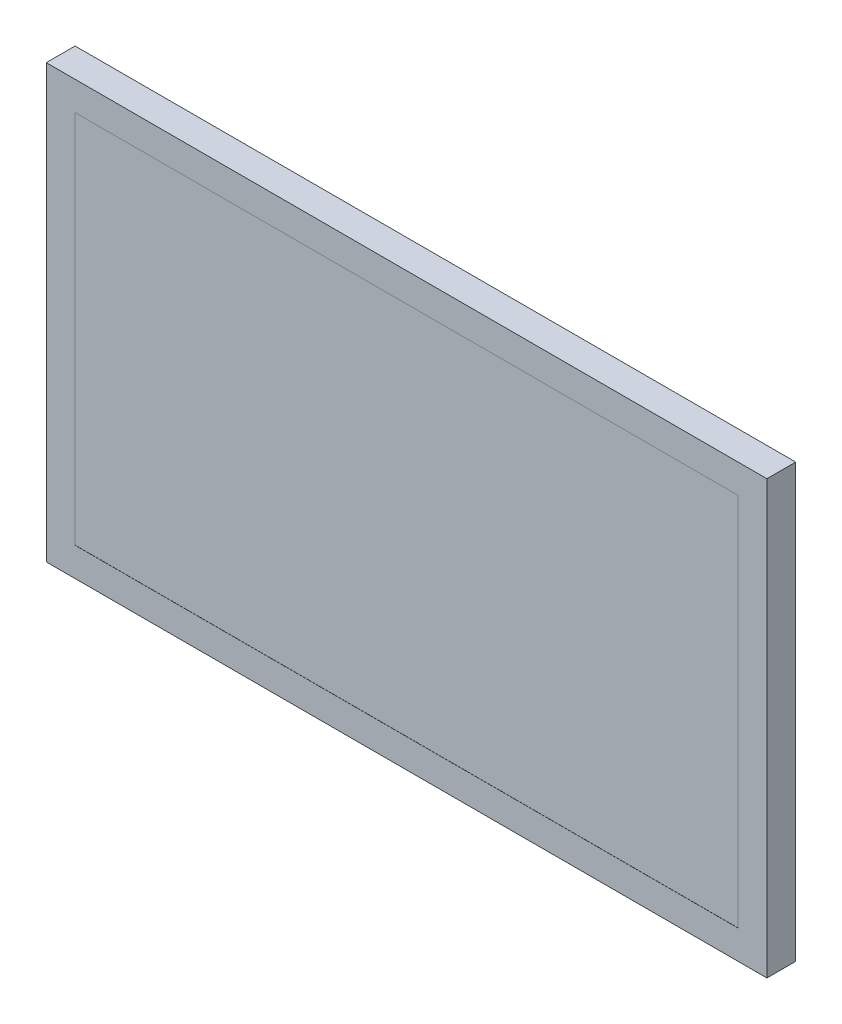
ISO-10303-21;
HEADER;
FILE_DESCRIPTION(('STEP AP214'),'2;1');
FILE_NAME('part.step','',(''),(''),'','','');
FILE_SCHEMA(('AUTOMOTIVE_DESIGN { 1 0 10303 214 1 1 1 1 }'));
ENDSEC;
DATA;
#1=APPLICATION_CONTEXT('core data for automotive mechanical design processes');
#2=APPLICATION_PROTOCOL_DEFINITION('international standard','automotive_design',2000,#1);
#3=PRODUCT_CONTEXT('',#1,'mechanical');
#4=PRODUCT('Part','Part','',(#3));
#5=PRODUCT_RELATED_PRODUCT_CATEGORY('part','',(#4));
#6=PRODUCT_DEFINITION_FORMATION('','',#4);
#7=PRODUCT_DEFINITION_CONTEXT('part definition',#1,'design');
#8=PRODUCT_DEFINITION('design','',#6,#7);
#9=PRODUCT_DEFINITION_SHAPE('','',#8);
#10=(LENGTH_UNIT() NAMED_UNIT(*) SI_UNIT(.MILLI.,.METRE.));
#11=(NAMED_UNIT(*) PLANE_ANGLE_UNIT() SI_UNIT($,.RADIAN.));
#12=(NAMED_UNIT(*) SI_UNIT($,.STERADIAN.) SOLID_ANGLE_UNIT());
#13=UNCERTAINTY_MEASURE_WITH_UNIT(LENGTH_MEASURE(1.E-05),#10,'distance_accuracy_value','');
#14=(GEOMETRIC_REPRESENTATION_CONTEXT(3) GLOBAL_UNCERTAINTY_ASSIGNED_CONTEXT((#13)) GLOBAL_UNIT_ASSIGNED_CONTEXT((#10,
#11,#12)) REPRESENTATION_CONTEXT('',''));
#15=CARTESIAN_POINT('',(0.,0.,0.));
#16=DIRECTION('',(0.,0.,1.));
#17=DIRECTION('',(1.,0.,0.));
#18=AXIS2_PLACEMENT_3D('',#15,#16,#17);
#19=CARTESIAN_POINT('',(-250.,-150.,20.));
#20=DIRECTION('',(1.,0.,0.));
#21=DIRECTION('',(0.,0.,-1.));
#22=AXIS2_PLACEMENT_3D('',#19,#20,#21);
#23=PLANE('',#22);
#24=DIRECTION('',(0.,-1.,0.));
#25=VECTOR('',#24,1.);
#26=CARTESIAN_POINT('',(-250.,-150.,0.));
#27=LINE('',#26,#25);
#28=CARTESIAN_POINT('',(-250.,150.,0.));
#29=VERTEX_POINT('',#28);
#30=CARTESIAN_POINT('',(-250.,-150.,0.));
#31=VERTEX_POINT('',#30);
#32=EDGE_CURVE('E141',#29,#31,#27,.T.);
#33=ORIENTED_EDGE('',*,*,#32,.T.);
#34=DIRECTION('',(0.,0.,-1.));
#35=VECTOR('',#34,1.);
#36=CARTESIAN_POINT('',(-250.,-150.,20.));
#37=LINE('',#36,#35);
#38=CARTESIAN_POINT('',(-250.,-150.,20.));
#39=VERTEX_POINT('',#38);
#40=EDGE_CURVE('E11',#39,#31,#37,.T.);
#41=ORIENTED_EDGE('',*,*,#40,.F.);
#42=DIRECTION('',(0.,-1.,0.));
#43=VECTOR('',#42,1.);
#44=CARTESIAN_POINT('',(-250.,-150.,20.));
#45=LINE('',#44,#43);
#46=CARTESIAN_POINT('',(-250.,150.,20.));
#47=VERTEX_POINT('',#46);
#48=EDGE_CURVE('E145',#47,#39,#45,.T.);
#49=ORIENTED_EDGE('',*,*,#48,.F.);
#50=DIRECTION('',(0.,0.,-1.));
#51=VECTOR('',#50,1.);
#52=CARTESIAN_POINT('',(-250.,150.,20.));
#53=LINE('',#52,#51);
#54=EDGE_CURVE('E151',#47,#29,#53,.T.);
#55=ORIENTED_EDGE('',*,*,#54,.T.);
#56=EDGE_LOOP('',(#33,#41,#49,#55));
#57=FACE_BOUND('',#56,.T.);
#58=ADVANCED_FACE('F33',(#57),#23,.F.);
#59=CARTESIAN_POINT('',(250.,-150.,20.));
#60=DIRECTION('',(0.,1.,0.));
#61=DIRECTION('',(-1.,0.,0.));
#62=AXIS2_PLACEMENT_3D('',#59,#60,#61);
#63=PLANE('',#62);
#64=DIRECTION('',(1.,0.,0.));
#65=VECTOR('',#64,1.);
#66=CARTESIAN_POINT('',(250.,-150.,0.));
#67=LINE('',#66,#65);
#68=CARTESIAN_POINT('',(250.,-150.,0.));
#69=VERTEX_POINT('',#68);
#70=EDGE_CURVE('E154',#31,#69,#67,.T.);
#71=ORIENTED_EDGE('',*,*,#70,.T.);
#72=DIRECTION('',(0.,0.,-1.));
#73=VECTOR('',#72,1.);
#74=CARTESIAN_POINT('',(250.,-150.,20.));
#75=LINE('',#74,#73);
#76=CARTESIAN_POINT('',(250.,-150.,20.));
#77=VERTEX_POINT('',#76);
#78=EDGE_CURVE('E40',#77,#69,#75,.T.);
#79=ORIENTED_EDGE('',*,*,#78,.F.);
#80=DIRECTION('',(1.,0.,0.));
#81=VECTOR('',#80,1.);
#82=CARTESIAN_POINT('',(250.,-150.,20.));
#83=LINE('',#82,#81);
#84=EDGE_CURVE('E84',#39,#77,#83,.T.);
#85=ORIENTED_EDGE('',*,*,#84,.F.);
#86=ORIENTED_EDGE('',*,*,#40,.T.);
#87=EDGE_LOOP('',(#71,#79,#85,#86));
#88=FACE_BOUND('',#87,.T.);
#89=ADVANCED_FACE('F183',(#88),#63,.F.);
#90=CARTESIAN_POINT('',(250.,-150.,20.));
#91=DIRECTION('',(-1.,0.,0.));
#92=DIRECTION('',(0.,0.,1.));
#93=AXIS2_PLACEMENT_3D('',#90,#91,#92);
#94=PLANE('',#93);
#95=DIRECTION('',(0.,1.,0.));
#96=VECTOR('',#95,1.);
#97=CARTESIAN_POINT('',(250.,-150.,0.));
#98=LINE('',#97,#96);
#99=CARTESIAN_POINT('',(250.,150.,0.));
#100=VERTEX_POINT('',#99);
#101=EDGE_CURVE('E156',#69,#100,#98,.T.);
#102=ORIENTED_EDGE('',*,*,#101,.T.);
#103=DIRECTION('',(0.,0.,-1.));
#104=VECTOR('',#103,1.);
#105=CARTESIAN_POINT('',(250.,150.,20.));
#106=LINE('',#105,#104);
#107=CARTESIAN_POINT('',(250.,150.,20.));
#108=VERTEX_POINT('',#107);
#109=EDGE_CURVE('E160',#108,#100,#106,.T.);
#110=ORIENTED_EDGE('',*,*,#109,.F.);
#111=DIRECTION('',(0.,1.,0.));
#112=VECTOR('',#111,1.);
#113=CARTESIAN_POINT('',(250.,-150.,20.));
#114=LINE('',#113,#112);
#115=EDGE_CURVE('E148',#77,#108,#114,.T.);
#116=ORIENTED_EDGE('',*,*,#115,.F.);
#117=ORIENTED_EDGE('',*,*,#78,.T.);
#118=EDGE_LOOP('',(#102,#110,#116,#117));
#119=FACE_BOUND('',#118,.T.);
#120=ADVANCED_FACE('F165',(#119),#94,.F.);
#121=CARTESIAN_POINT('',(250.,150.,20.));
#122=DIRECTION('',(0.,-1.,0.));
#123=DIRECTION('',(1.,0.,0.));
#124=AXIS2_PLACEMENT_3D('',#121,#122,#123);
#125=PLANE('',#124);
#126=DIRECTION('',(-1.,0.,0.));
#127=VECTOR('',#126,1.);
#128=CARTESIAN_POINT('',(250.,150.,0.));
#129=LINE('',#128,#127);
#130=EDGE_CURVE('E77',#100,#29,#129,.T.);
#131=ORIENTED_EDGE('',*,*,#130,.T.);
#132=ORIENTED_EDGE('',*,*,#54,.F.);
#133=DIRECTION('',(-1.,0.,0.));
#134=VECTOR('',#133,1.);
#135=CARTESIAN_POINT('',(250.,150.,20.));
#136=LINE('',#135,#134);
#137=EDGE_CURVE('E56',#108,#47,#136,.T.);
#138=ORIENTED_EDGE('',*,*,#137,.F.);
#139=ORIENTED_EDGE('',*,*,#109,.T.);
#140=EDGE_LOOP('',(#131,#132,#138,#139));
#141=FACE_BOUND('',#140,.T.);
#142=ADVANCED_FACE('F173',(#141),#125,.F.);
#143=CARTESIAN_POINT('',(0.,0.,20.));
#144=DIRECTION('',(0.,0.,1.));
#145=DIRECTION('',(1.,0.,0.));
#146=AXIS2_PLACEMENT_3D('',#143,#144,#145);
#147=PLANE('',#146);
#148=DIRECTION('',(0.,-1.,0.));
#149=VECTOR('',#148,1.);
#150=CARTESIAN_POINT('',(-230.,-130.,20.));
#151=LINE('',#150,#149);
#152=CARTESIAN_POINT('',(-230.,130.,20.));
#153=VERTEX_POINT('',#152);
#154=CARTESIAN_POINT('',(-230.,-130.,20.));
#155=VERTEX_POINT('',#154);
#156=EDGE_CURVE('E47',#153,#155,#151,.T.);
#157=ORIENTED_EDGE('',*,*,#156,.F.);
#158=DIRECTION('',(-1.,0.,0.));
#159=VECTOR('',#158,1.);
#160=CARTESIAN_POINT('',(230.,130.,20.));
#161=LINE('',#160,#159);
#162=CARTESIAN_POINT('',(230.,130.,20.));
#163=VERTEX_POINT('',#162);
#164=EDGE_CURVE('E126',#163,#153,#161,.T.);
#165=ORIENTED_EDGE('',*,*,#164,.F.);
#166=DIRECTION('',(0.,1.,0.));
#167=VECTOR('',#166,1.);
#168=CARTESIAN_POINT('',(230.,-130.,20.));
#169=LINE('',#168,#167);
#170=CARTESIAN_POINT('',(230.,-130.,20.));
#171=VERTEX_POINT('',#170);
#172=EDGE_CURVE('E129',#171,#163,#169,.T.);
#173=ORIENTED_EDGE('',*,*,#172,.F.);
#174=DIRECTION('',(1.,0.,0.));
#175=VECTOR('',#174,1.);
#176=CARTESIAN_POINT('',(230.,-130.,20.));
#177=LINE('',#176,#175);
#178=EDGE_CURVE('E135',#155,#171,#177,.T.);
#179=ORIENTED_EDGE('',*,*,#178,.F.);
#180=EDGE_LOOP('',(#157,#165,#173,#179));
#181=FACE_BOUND('',#180,.T.);
#182=ORIENTED_EDGE('',*,*,#48,.T.);
#183=ORIENTED_EDGE('',*,*,#84,.T.);
#184=ORIENTED_EDGE('',*,*,#115,.T.);
#185=ORIENTED_EDGE('',*,*,#137,.T.);
#186=EDGE_LOOP('',(#182,#183,#184,#185));
#187=FACE_BOUND('',#186,.T.);
#188=ADVANCED_FACE('F175',(#181,#187),#147,.T.);
#189=CARTESIAN_POINT('',(0.,0.,0.));
#190=DIRECTION('',(0.,0.,1.));
#191=DIRECTION('',(1.,0.,0.));
#192=AXIS2_PLACEMENT_3D('',#189,#190,#191);
#193=PLANE('',#192);
#194=ORIENTED_EDGE('',*,*,#32,.F.);
#195=ORIENTED_EDGE('',*,*,#130,.F.);
#196=ORIENTED_EDGE('',*,*,#101,.F.);
#197=ORIENTED_EDGE('',*,*,#70,.F.);
#198=EDGE_LOOP('',(#194,#195,#196,#197));
#199=FACE_BOUND('',#198,.T.);
#200=ADVANCED_FACE('F169',(#199),#193,.F.);
#201=CARTESIAN_POINT('',(-230.,-130.,19.9));
#202=DIRECTION('',(-1.,0.,0.));
#203=DIRECTION('',(0.,0.,1.));
#204=AXIS2_PLACEMENT_3D('',#201,#202,#203);
#205=PLANE('',#204);
#206=ORIENTED_EDGE('',*,*,#156,.T.);
#207=DIRECTION('',(0.,0.,1.));
#208=VECTOR('',#207,1.);
#209=CARTESIAN_POINT('',(-230.,-130.,19.9));
#210=LINE('',#209,#208);
#211=CARTESIAN_POINT('',(-230.,-130.,19.9));
#212=VERTEX_POINT('',#211);
#213=EDGE_CURVE('E104',#212,#155,#210,.T.);
#214=ORIENTED_EDGE('',*,*,#213,.F.);
#215=DIRECTION('',(0.,-1.,0.));
#216=VECTOR('',#215,1.);
#217=CARTESIAN_POINT('',(-230.,-130.,19.9));
#218=LINE('',#217,#216);
#219=CARTESIAN_POINT('',(-230.,130.,19.9));
#220=VERTEX_POINT('',#219);
#221=EDGE_CURVE('E108',#220,#212,#218,.T.);
#222=ORIENTED_EDGE('',*,*,#221,.F.);
#223=DIRECTION('',(0.,0.,1.));
#224=VECTOR('',#223,1.);
#225=CARTESIAN_POINT('',(-230.,130.,19.9));
#226=LINE('',#225,#224);
#227=EDGE_CURVE('E139',#220,#153,#226,.T.);
#228=ORIENTED_EDGE('',*,*,#227,.T.);
#229=EDGE_LOOP('',(#206,#214,#222,#228));
#230=FACE_BOUND('',#229,.T.);
#231=ADVANCED_FACE('F106',(#230),#205,.F.);
#232=CARTESIAN_POINT('',(230.,130.,19.9));
#233=DIRECTION('',(0.,1.,0.));
#234=DIRECTION('',(0.,0.,1.));
#235=AXIS2_PLACEMENT_3D('',#232,#233,#234);
#236=PLANE('',#235);
#237=ORIENTED_EDGE('',*,*,#164,.T.);
#238=ORIENTED_EDGE('',*,*,#227,.F.);
#239=DIRECTION('',(-1.,0.,0.));
#240=VECTOR('',#239,1.);
#241=CARTESIAN_POINT('',(230.,130.,19.9));
#242=LINE('',#241,#240);
#243=CARTESIAN_POINT('',(230.,130.,19.9));
#244=VERTEX_POINT('',#243);
#245=EDGE_CURVE('E114',#244,#220,#242,.T.);
#246=ORIENTED_EDGE('',*,*,#245,.F.);
#247=DIRECTION('',(0.,0.,1.));
#248=VECTOR('',#247,1.);
#249=CARTESIAN_POINT('',(230.,130.,19.9));
#250=LINE('',#249,#248);
#251=EDGE_CURVE('E142',#244,#163,#250,.T.);
#252=ORIENTED_EDGE('',*,*,#251,.T.);
#253=EDGE_LOOP('',(#237,#238,#246,#252));
#254=FACE_BOUND('',#253,.T.);
#255=ADVANCED_FACE('F222',(#254),#236,.F.);
#256=CARTESIAN_POINT('',(230.,-130.,19.9));
#257=DIRECTION('',(1.,0.,0.));
#258=DIRECTION('',(0.,0.,-1.));
#259=AXIS2_PLACEMENT_3D('',#256,#257,#258);
#260=PLANE('',#259);
#261=ORIENTED_EDGE('',*,*,#172,.T.);
#262=ORIENTED_EDGE('',*,*,#251,.F.);
#263=DIRECTION('',(0.,1.,0.));
#264=VECTOR('',#263,1.);
#265=CARTESIAN_POINT('',(230.,-130.,19.9));
#266=LINE('',#265,#264);
#267=CARTESIAN_POINT('',(230.,-130.,19.9));
#268=VERTEX_POINT('',#267);
#269=EDGE_CURVE('E122',#268,#244,#266,.T.);
#270=ORIENTED_EDGE('',*,*,#269,.F.);
#271=DIRECTION('',(0.,0.,1.));
#272=VECTOR('',#271,1.);
#273=CARTESIAN_POINT('',(230.,-130.,19.9));
#274=LINE('',#273,#272);
#275=EDGE_CURVE('E113',#268,#171,#274,.T.);
#276=ORIENTED_EDGE('',*,*,#275,.T.);
#277=EDGE_LOOP('',(#261,#262,#270,#276));
#278=FACE_BOUND('',#277,.T.);
#279=ADVANCED_FACE('F231',(#278),#260,.F.);
#280=CARTESIAN_POINT('',(230.,-130.,19.9));
#281=DIRECTION('',(0.,-1.,0.));
#282=DIRECTION('',(0.,0.,-1.));
#283=AXIS2_PLACEMENT_3D('',#280,#281,#282);
#284=PLANE('',#283);
#285=ORIENTED_EDGE('',*,*,#178,.T.);
#286=ORIENTED_EDGE('',*,*,#275,.F.);
#287=DIRECTION('',(1.,0.,0.));
#288=VECTOR('',#287,1.);
#289=CARTESIAN_POINT('',(230.,-130.,19.9));
#290=LINE('',#289,#288);
#291=EDGE_CURVE('E117',#212,#268,#290,.T.);
#292=ORIENTED_EDGE('',*,*,#291,.F.);
#293=ORIENTED_EDGE('',*,*,#213,.T.);
#294=EDGE_LOOP('',(#285,#286,#292,#293));
#295=FACE_BOUND('',#294,.T.);
#296=ADVANCED_FACE('F118',(#295),#284,.F.);
#297=CARTESIAN_POINT('',(0.,0.,19.9));
#298=DIRECTION('',(0.,0.,1.));
#299=DIRECTION('',(1.,0.,0.));
#300=AXIS2_PLACEMENT_3D('',#297,#298,#299);
#301=PLANE('',#300);
#302=ORIENTED_EDGE('',*,*,#221,.T.);
#303=ORIENTED_EDGE('',*,*,#291,.T.);
#304=ORIENTED_EDGE('',*,*,#269,.T.);
#305=ORIENTED_EDGE('',*,*,#245,.T.);
#306=EDGE_LOOP('',(#302,#303,#304,#305));
#307=FACE_BOUND('',#306,.T.);
#308=ADVANCED_FACE('F124',(#307),#301,.T.);
#309=CLOSED_SHELL('',(#58,#89,#120,#142,#188,#200,#231,#255,#279,#296,#308));
#310=MANIFOLD_SOLID_BREP('B2',#309);
#311=ADVANCED_BREP_SHAPE_REPRESENTATION('',(#18,#310),#14);
#312=SHAPE_DEFINITION_REPRESENTATION(#9,#311);
ENDSEC;
END-ISO-10303-21;
